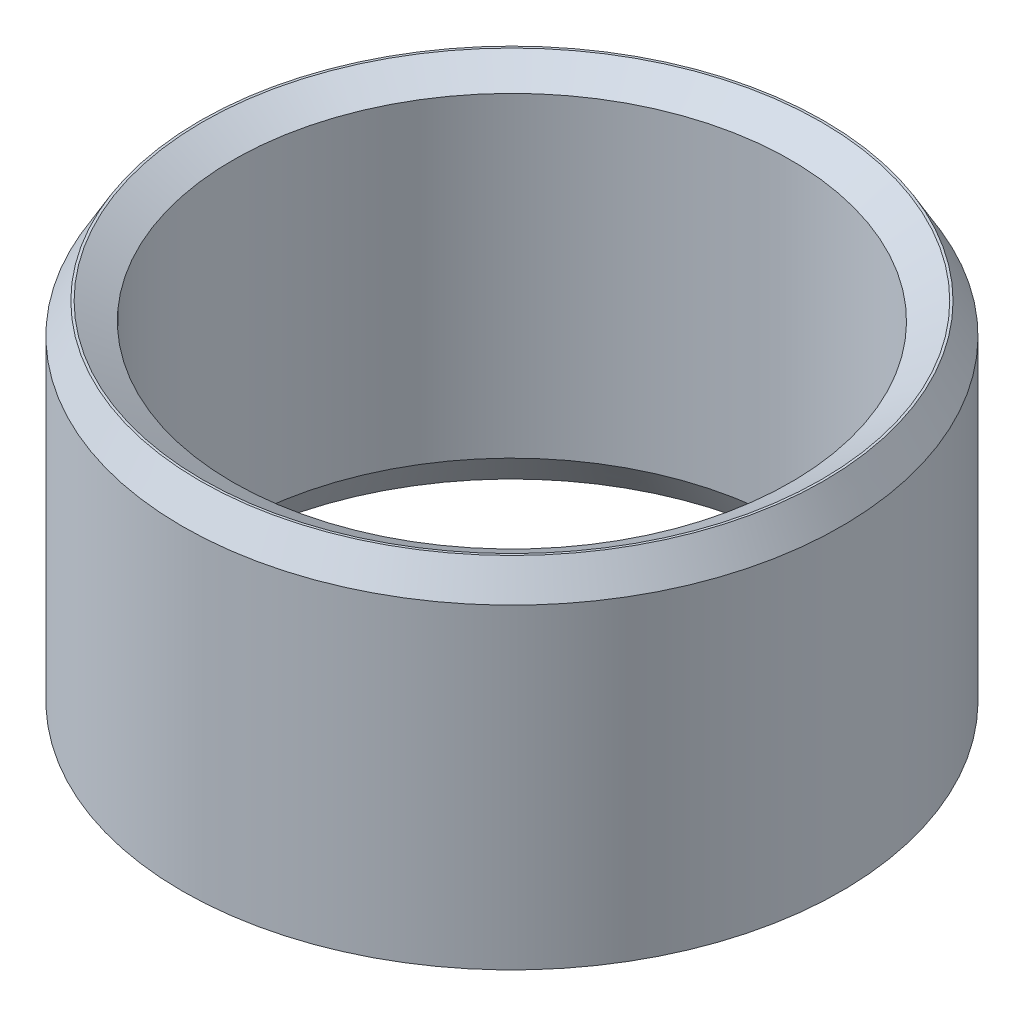
ISO-10303-21;
HEADER;
FILE_DESCRIPTION(('STEP AP214'),'2;1');
FILE_NAME('part.step','',(''),(''),'','','');
FILE_SCHEMA(('AUTOMOTIVE_DESIGN { 1 0 10303 214 1 1 1 1 }'));
ENDSEC;
DATA;
#1=APPLICATION_CONTEXT('core data for automotive mechanical design processes');
#2=APPLICATION_PROTOCOL_DEFINITION('international standard','automotive_design',2000,#1);
#3=PRODUCT_CONTEXT('',#1,'mechanical');
#4=PRODUCT('Part','Part','',(#3));
#5=PRODUCT_RELATED_PRODUCT_CATEGORY('part','',(#4));
#6=PRODUCT_DEFINITION_FORMATION('','',#4);
#7=PRODUCT_DEFINITION_CONTEXT('part definition',#1,'design');
#8=PRODUCT_DEFINITION('design','',#6,#7);
#9=PRODUCT_DEFINITION_SHAPE('','',#8);
#10=(LENGTH_UNIT() NAMED_UNIT(*) SI_UNIT(.MILLI.,.METRE.));
#11=(NAMED_UNIT(*) PLANE_ANGLE_UNIT() SI_UNIT($,.RADIAN.));
#12=(NAMED_UNIT(*) SI_UNIT($,.STERADIAN.) SOLID_ANGLE_UNIT());
#13=UNCERTAINTY_MEASURE_WITH_UNIT(LENGTH_MEASURE(1.E-05),#10,'distance_accuracy_value','');
#14=(GEOMETRIC_REPRESENTATION_CONTEXT(3) GLOBAL_UNCERTAINTY_ASSIGNED_CONTEXT((#13)) GLOBAL_UNIT_ASSIGNED_CONTEXT((#10,
#11,#12)) REPRESENTATION_CONTEXT('',''));
#15=CARTESIAN_POINT('',(0.,0.,0.));
#16=DIRECTION('',(0.,0.,1.));
#17=DIRECTION('',(1.,0.,0.));
#18=AXIS2_PLACEMENT_3D('',#15,#16,#17);
#19=CARTESIAN_POINT('',(0.,44.192319107174,0.));
#20=DIRECTION('',(0.,-1.,0.));
#21=DIRECTION('',(0.,0.,-1.));
#22=AXIS2_PLACEMENT_3D('',#19,#20,#21);
#23=CYLINDRICAL_SURFACE('',#22,40.);
#24=CARTESIAN_POINT('',(0.,2.14171270389681,0.));
#25=DIRECTION('',(0.,1.,0.));
#26=DIRECTION('',(0.,0.,1.));
#27=AXIS2_PLACEMENT_3D('',#24,#25,#26);
#28=CIRCLE('',#27,40.);
#29=CARTESIAN_POINT('',(0.,2.14171270389681,40.));
#30=VERTEX_POINT('',#29);
#31=EDGE_CURVE('E10',#30,#30,#28,.T.);
#32=ORIENTED_EDGE('',*,*,#31,.T.);
#33=EDGE_LOOP('',(#32));
#34=FACE_BOUND('',#33,.T.);
#35=CARTESIAN_POINT('',(0.,40.482763888809,0.));
#36=DIRECTION('',(0.,1.,0.));
#37=DIRECTION('',(0.,0.,1.));
#38=AXIS2_PLACEMENT_3D('',#35,#36,#37);
#39=CIRCLE('',#38,40.);
#40=CARTESIAN_POINT('',(0.,40.482763888809,40.));
#41=VERTEX_POINT('',#40);
#42=EDGE_CURVE('E50',#41,#41,#39,.F.);
#43=ORIENTED_EDGE('',*,*,#42,.T.);
#44=EDGE_LOOP('',(#43));
#45=FACE_BOUND('',#44,.T.);
#46=ADVANCED_FACE('F39',(#34,#45),#23,.T.);
#47=CARTESIAN_POINT('',(0.,44.192319107174,0.));
#48=DIRECTION('',(0.,1.,0.));
#49=DIRECTION('',(0.,0.,1.));
#50=AXIS2_PLACEMENT_3D('',#47,#48,#49);
#51=PLANE('',#50);
#52=CARTESIAN_POINT('',(0.,44.192319107174,0.));
#53=DIRECTION('',(0.,1.,0.));
#54=DIRECTION('',(0.,0.,1.));
#55=AXIS2_PLACEMENT_3D('',#52,#53,#54);
#56=CIRCLE('',#55,37.5754024182958);
#57=CARTESIAN_POINT('',(0.,44.192319107174,37.5754024182958));
#58=VERTEX_POINT('',#57);
#59=EDGE_CURVE('E58',#58,#58,#56,.F.);
#60=ORIENTED_EDGE('',*,*,#59,.T.);
#61=EDGE_LOOP('',(#60));
#62=FACE_BOUND('',#61,.T.);
#63=CARTESIAN_POINT('',(0.,44.192319107174,0.));
#64=DIRECTION('',(0.,1.,0.));
#65=DIRECTION('',(0.,0.,1.));
#66=AXIS2_PLACEMENT_3D('',#63,#64,#65);
#67=CIRCLE('',#66,37.8582872961032);
#68=CARTESIAN_POINT('',(0.,44.192319107174,37.8582872961032));
#69=VERTEX_POINT('',#68);
#70=EDGE_CURVE('E61',#69,#69,#67,.T.);
#71=ORIENTED_EDGE('',*,*,#70,.T.);
#72=EDGE_LOOP('',(#71));
#73=FACE_BOUND('',#72,.T.);
#74=ADVANCED_FACE('F88',(#62,#73),#51,.T.);
#75=CARTESIAN_POINT('',(0.,0.,0.));
#76=DIRECTION('',(0.,1.,0.));
#77=DIRECTION('',(0.,0.,1.));
#78=AXIS2_PLACEMENT_3D('',#75,#76,#77);
#79=PLANE('',#78);
#80=CARTESIAN_POINT('',(0.,0.,0.));
#81=DIRECTION('',(0.,1.,0.));
#82=DIRECTION('',(0.,0.,1.));
#83=AXIS2_PLACEMENT_3D('',#80,#81,#82);
#84=CIRCLE('',#83,36.0075599038276);
#85=CARTESIAN_POINT('',(0.,0.,36.0075599038276));
#86=VERTEX_POINT('',#85);
#87=EDGE_CURVE('E51',#86,#86,#84,.T.);
#88=ORIENTED_EDGE('',*,*,#87,.T.);
#89=EDGE_LOOP('',(#88));
#90=FACE_BOUND('',#89,.T.);
#91=CARTESIAN_POINT('',(0.,0.,0.));
#92=DIRECTION('',(0.,1.,0.));
#93=DIRECTION('',(0.,0.,1.));
#94=AXIS2_PLACEMENT_3D('',#91,#92,#93);
#95=CIRCLE('',#94,36.290444781635);
#96=CARTESIAN_POINT('',(0.,0.,36.290444781635));
#97=VERTEX_POINT('',#96);
#98=EDGE_CURVE('E54',#97,#97,#95,.F.);
#99=ORIENTED_EDGE('',*,*,#98,.T.);
#100=EDGE_LOOP('',(#99));
#101=FACE_BOUND('',#100,.T.);
#102=ADVANCED_FACE('F83',(#90,#101),#79,.F.);
#103=CARTESIAN_POINT('',(0.,44.192319107174,0.));
#104=DIRECTION('',(0.,-1.,0.));
#105=DIRECTION('',(0.,0.,-1.));
#106=AXIS2_PLACEMENT_3D('',#103,#104,#105);
#107=CYLINDRICAL_SURFACE('',#106,33.8658471999307);
#108=CARTESIAN_POINT('',(0.,42.0506064032772,0.));
#109=DIRECTION('',(0.,1.,0.));
#110=DIRECTION('',(0.,0.,1.));
#111=AXIS2_PLACEMENT_3D('',#108,#109,#110);
#112=CIRCLE('',#111,33.8658471999307);
#113=CARTESIAN_POINT('',(0.,42.0506064032772,33.8658471999307));
#114=VERTEX_POINT('',#113);
#115=EDGE_CURVE('E67',#114,#114,#112,.T.);
#116=ORIENTED_EDGE('',*,*,#115,.T.);
#117=EDGE_LOOP('',(#116));
#118=FACE_BOUND('',#117,.T.);
#119=CARTESIAN_POINT('',(0.,3.70955521836506,0.));
#120=DIRECTION('',(0.,1.,0.));
#121=DIRECTION('',(0.,0.,1.));
#122=AXIS2_PLACEMENT_3D('',#119,#120,#121);
#123=CIRCLE('',#122,33.8658471999307);
#124=CARTESIAN_POINT('',(0.,3.70955521836506,33.8658471999307));
#125=VERTEX_POINT('',#124);
#126=EDGE_CURVE('E69',#125,#125,#123,.F.);
#127=ORIENTED_EDGE('',*,*,#126,.T.);
#128=EDGE_LOOP('',(#127));
#129=FACE_BOUND('',#128,.T.);
#130=ADVANCED_FACE('F71',(#118,#129),#107,.F.);
#131=CARTESIAN_POINT('',(0.,42.0506064032772,0.));
#132=DIRECTION('',(0.,1.,0.));
#133=DIRECTION('',(0.,0.,1.));
#134=AXIS2_PLACEMENT_3D('',#131,#132,#133);
#135=CONICAL_SURFACE('',#134,33.8658471999307,1.0471975511966);
#136=ORIENTED_EDGE('',*,*,#59,.F.);
#137=EDGE_LOOP('',(#136));
#138=FACE_BOUND('',#137,.T.);
#139=ORIENTED_EDGE('',*,*,#115,.F.);
#140=EDGE_LOOP('',(#139));
#141=FACE_BOUND('',#140,.T.);
#142=ADVANCED_FACE('F77',(#138,#141),#135,.F.);
#143=CARTESIAN_POINT('',(0.,0.,0.));
#144=DIRECTION('',(0.,-1.,0.));
#145=DIRECTION('',(0.,0.,-1.));
#146=AXIS2_PLACEMENT_3D('',#143,#144,#145);
#147=CONICAL_SURFACE('',#146,36.0075599038276,0.523598775598293);
#148=ORIENTED_EDGE('',*,*,#126,.F.);
#149=EDGE_LOOP('',(#148));
#150=FACE_BOUND('',#149,.T.);
#151=ORIENTED_EDGE('',*,*,#87,.F.);
#152=EDGE_LOOP('',(#151));
#153=FACE_BOUND('',#152,.T.);
#154=ADVANCED_FACE('F73',(#150,#153),#147,.F.);
#155=CARTESIAN_POINT('',(0.,2.14171270389681,0.));
#156=DIRECTION('',(0.,1.,0.));
#157=DIRECTION('',(0.,0.,1.));
#158=AXIS2_PLACEMENT_3D('',#155,#156,#157);
#159=CONICAL_SURFACE('',#158,40.,1.0471975511966);
#160=ORIENTED_EDGE('',*,*,#98,.F.);
#161=EDGE_LOOP('',(#160));
#162=FACE_BOUND('',#161,.T.);
#163=ORIENTED_EDGE('',*,*,#31,.F.);
#164=EDGE_LOOP('',(#163));
#165=FACE_BOUND('',#164,.T.);
#166=ADVANCED_FACE('F76',(#162,#165),#159,.T.);
#167=CARTESIAN_POINT('',(0.,44.192319107174,0.));
#168=DIRECTION('',(0.,-1.,0.));
#169=DIRECTION('',(0.,0.,-1.));
#170=AXIS2_PLACEMENT_3D('',#167,#168,#169);
#171=CONICAL_SURFACE('',#170,37.8582872961032,0.523598775598295);
#172=ORIENTED_EDGE('',*,*,#42,.F.);
#173=EDGE_LOOP('',(#172));
#174=FACE_BOUND('',#173,.T.);
#175=ORIENTED_EDGE('',*,*,#70,.F.);
#176=EDGE_LOOP('',(#175));
#177=FACE_BOUND('',#176,.T.);
#178=ADVANCED_FACE('F45',(#174,#177),#171,.T.);
#179=CLOSED_SHELL('',(#46,#74,#102,#130,#142,#154,#166,#178));
#180=MANIFOLD_SOLID_BREP('B2',#179);
#181=ADVANCED_BREP_SHAPE_REPRESENTATION('',(#18,#180),#14);
#182=SHAPE_DEFINITION_REPRESENTATION(#9,#181);
ENDSEC;
END-ISO-10303-21;
